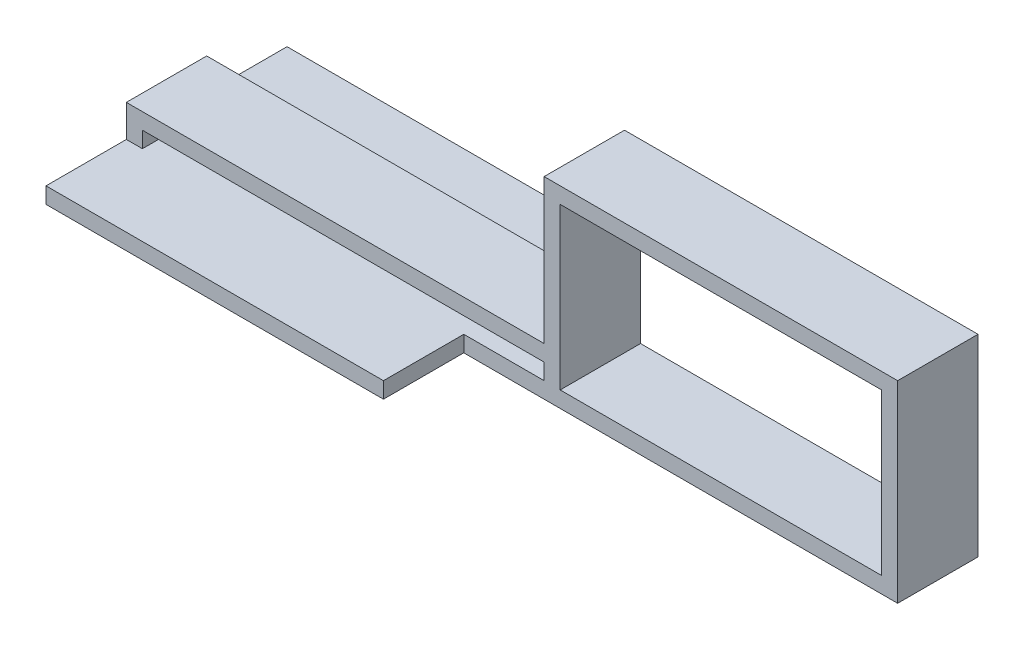
ISO-10303-21;
HEADER;
FILE_DESCRIPTION(('STEP AP214'),'2;1');
FILE_NAME('part.step','',(''),(''),'','','');
FILE_SCHEMA(('AUTOMOTIVE_DESIGN { 1 0 10303 214 1 1 1 1 }'));
ENDSEC;
DATA;
#1=APPLICATION_CONTEXT('core data for automotive mechanical design processes');
#2=APPLICATION_PROTOCOL_DEFINITION('international standard','automotive_design',2000,#1);
#3=PRODUCT_CONTEXT('',#1,'mechanical');
#4=PRODUCT('Part','Part','',(#3));
#5=PRODUCT_RELATED_PRODUCT_CATEGORY('part','',(#4));
#6=PRODUCT_DEFINITION_FORMATION('','',#4);
#7=PRODUCT_DEFINITION_CONTEXT('part definition',#1,'design');
#8=PRODUCT_DEFINITION('design','',#6,#7);
#9=PRODUCT_DEFINITION_SHAPE('','',#8);
#10=(LENGTH_UNIT() NAMED_UNIT(*) SI_UNIT(.MILLI.,.METRE.));
#11=(NAMED_UNIT(*) PLANE_ANGLE_UNIT() SI_UNIT($,.RADIAN.));
#12=(NAMED_UNIT(*) SI_UNIT($,.STERADIAN.) SOLID_ANGLE_UNIT());
#13=UNCERTAINTY_MEASURE_WITH_UNIT(LENGTH_MEASURE(1.E-05),#10,'distance_accuracy_value','');
#14=(GEOMETRIC_REPRESENTATION_CONTEXT(3) GLOBAL_UNCERTAINTY_ASSIGNED_CONTEXT((#13)) GLOBAL_UNIT_ASSIGNED_CONTEXT((#10,
#11,#12)) REPRESENTATION_CONTEXT('',''));
#15=CARTESIAN_POINT('',(0.,0.,0.));
#16=DIRECTION('',(0.,0.,1.));
#17=DIRECTION('',(1.,0.,0.));
#18=AXIS2_PLACEMENT_3D('',#15,#16,#17);
#19=CARTESIAN_POINT('',(-22.1705882352941,0.,-5.));
#20=DIRECTION('',(1.,0.,0.));
#21=DIRECTION('',(0.,0.,-1.));
#22=AXIS2_PLACEMENT_3D('',#19,#20,#21);
#23=PLANE('',#22);
#24=DIRECTION('',(0.,0.,1.));
#25=VECTOR('',#24,1.);
#26=CARTESIAN_POINT('',(-22.1705882352941,-22.2872549019608,-5.));
#27=LINE('',#26,#25);
#28=CARTESIAN_POINT('',(-22.1705882352941,-22.2872549019608,-5.));
#29=VERTEX_POINT('',#28);
#30=CARTESIAN_POINT('',(-22.1705882352941,-22.2872549019608,5.));
#31=VERTEX_POINT('',#30);
#32=EDGE_CURVE('E356',#29,#31,#27,.T.);
#33=ORIENTED_EDGE('',*,*,#32,.T.);
#34=DIRECTION('',(0.,1.,0.));
#35=VECTOR('',#34,1.);
#36=CARTESIAN_POINT('',(-22.1705882352941,0.,5.));
#37=LINE('',#36,#35);
#38=CARTESIAN_POINT('',(-22.1705882352941,-20.2872549019608,5.));
#39=VERTEX_POINT('',#38);
#40=EDGE_CURVE('E283',#31,#39,#37,.T.);
#41=ORIENTED_EDGE('',*,*,#40,.T.);
#42=DIRECTION('',(0.,0.,1.));
#43=VECTOR('',#42,1.);
#44=CARTESIAN_POINT('',(-22.1705882352941,-20.2872549019608,-5.));
#45=LINE('',#44,#43);
#46=CARTESIAN_POINT('',(-22.1705882352941,-20.2872549019608,-5.));
#47=VERTEX_POINT('',#46);
#48=EDGE_CURVE('E347',#47,#39,#45,.T.);
#49=ORIENTED_EDGE('',*,*,#48,.F.);
#50=DIRECTION('',(0.,1.,0.));
#51=VECTOR('',#50,1.);
#52=CARTESIAN_POINT('',(-22.1705882352941,0.,-5.));
#53=LINE('',#52,#51);
#54=EDGE_CURVE('E332',#29,#47,#53,.T.);
#55=ORIENTED_EDGE('',*,*,#54,.F.);
#56=EDGE_LOOP('',(#33,#41,#49,#55));
#57=FACE_BOUND('',#56,.T.);
#58=ADVANCED_FACE('F41',(#57),#23,.F.);
#59=CARTESIAN_POINT('',(0.,-20.2872549019608,-5.));
#60=DIRECTION('',(0.,-1.,0.));
#61=DIRECTION('',(0.,0.,-1.));
#62=AXIS2_PLACEMENT_3D('',#59,#60,#61);
#63=PLANE('',#62);
#64=ORIENTED_EDGE('',*,*,#48,.T.);
#65=DIRECTION('',(1.,0.,0.));
#66=VECTOR('',#65,1.);
#67=CARTESIAN_POINT('',(0.,-20.2872549019608,5.));
#68=LINE('',#67,#66);
#69=CARTESIAN_POINT('',(-72.1705882352941,-20.2872549019608,5.));
#70=VERTEX_POINT('',#69);
#71=EDGE_CURVE('E295',#70,#39,#68,.T.);
#72=ORIENTED_EDGE('',*,*,#71,.F.);
#73=DIRECTION('',(0.,0.,1.));
#74=VECTOR('',#73,1.);
#75=CARTESIAN_POINT('',(-72.1705882352941,-20.2872549019608,-5.));
#76=LINE('',#75,#74);
#77=CARTESIAN_POINT('',(-72.1705882352941,-20.2872549019608,-5.));
#78=VERTEX_POINT('',#77);
#79=EDGE_CURVE('E350',#78,#70,#76,.T.);
#80=ORIENTED_EDGE('',*,*,#79,.F.);
#81=DIRECTION('',(1.,0.,0.));
#82=VECTOR('',#81,1.);
#83=CARTESIAN_POINT('',(0.,-20.2872549019608,-5.));
#84=LINE('',#83,#82);
#85=EDGE_CURVE('E342',#78,#47,#84,.T.);
#86=ORIENTED_EDGE('',*,*,#85,.T.);
#87=EDGE_LOOP('',(#64,#72,#80,#86));
#88=FACE_BOUND('',#87,.T.);
#89=ADVANCED_FACE('F450',(#88),#63,.T.);
#90=CARTESIAN_POINT('',(-72.1705882352941,0.,-5.));
#91=DIRECTION('',(1.,0.,0.));
#92=DIRECTION('',(0.,0.,-1.));
#93=AXIS2_PLACEMENT_3D('',#90,#91,#92);
#94=PLANE('',#93);
#95=ORIENTED_EDGE('',*,*,#79,.T.);
#96=DIRECTION('',(0.,1.,0.));
#97=VECTOR('',#96,1.);
#98=CARTESIAN_POINT('',(-72.1705882352941,0.,5.));
#99=LINE('',#98,#97);
#100=CARTESIAN_POINT('',(-72.1705882352941,-22.2872549019608,5.));
#101=VERTEX_POINT('',#100);
#102=EDGE_CURVE('E291',#101,#70,#99,.T.);
#103=ORIENTED_EDGE('',*,*,#102,.F.);
#104=DIRECTION('',(0.,0.,1.));
#105=VECTOR('',#104,1.);
#106=CARTESIAN_POINT('',(-72.1705882352941,-22.2872549019608,-5.));
#107=LINE('',#106,#105);
#108=CARTESIAN_POINT('',(-72.1705882352941,-22.2872549019608,-5.));
#109=VERTEX_POINT('',#108);
#110=EDGE_CURVE('E353',#109,#101,#107,.T.);
#111=ORIENTED_EDGE('',*,*,#110,.F.);
#112=DIRECTION('',(0.,1.,0.));
#113=VECTOR('',#112,1.);
#114=CARTESIAN_POINT('',(-72.1705882352941,0.,-5.));
#115=LINE('',#114,#113);
#116=EDGE_CURVE('E338',#109,#78,#115,.T.);
#117=ORIENTED_EDGE('',*,*,#116,.T.);
#118=EDGE_LOOP('',(#95,#103,#111,#117));
#119=FACE_BOUND('',#118,.T.);
#120=ADVANCED_FACE('F418',(#119),#94,.T.);
#121=CARTESIAN_POINT('',(0.,-2.28725490196078,-5.));
#122=DIRECTION('',(0.,-1.,0.));
#123=DIRECTION('',(0.,0.,-1.));
#124=AXIS2_PLACEMENT_3D('',#121,#122,#123);
#125=PLANE('',#124);
#126=DIRECTION('',(0.,0.,1.));
#127=VECTOR('',#126,1.);
#128=CARTESIAN_POINT('',(19.8294117647059,-2.28725490196078,-5.));
#129=LINE('',#128,#127);
#130=CARTESIAN_POINT('',(19.8294117647059,-2.28725490196078,-5.));
#131=VERTEX_POINT('',#130);
#132=CARTESIAN_POINT('',(19.8294117647059,-2.28725490196078,5.));
#133=VERTEX_POINT('',#132);
#134=EDGE_CURVE('E368',#131,#133,#129,.T.);
#135=ORIENTED_EDGE('',*,*,#134,.T.);
#136=DIRECTION('',(1.,0.,0.));
#137=VECTOR('',#136,1.);
#138=CARTESIAN_POINT('',(0.,-2.28725490196078,5.));
#139=LINE('',#138,#137);
#140=CARTESIAN_POINT('',(-20.1705882352941,-2.28725490196078,5.));
#141=VERTEX_POINT('',#140);
#142=EDGE_CURVE('E267',#141,#133,#139,.T.);
#143=ORIENTED_EDGE('',*,*,#142,.F.);
#144=DIRECTION('',(0.,0.,1.));
#145=VECTOR('',#144,1.);
#146=CARTESIAN_POINT('',(-20.1705882352941,-2.28725490196078,-5.));
#147=LINE('',#146,#145);
#148=CARTESIAN_POINT('',(-20.1705882352941,-2.28725490196078,-5.));
#149=VERTEX_POINT('',#148);
#150=EDGE_CURVE('E359',#149,#141,#147,.T.);
#151=ORIENTED_EDGE('',*,*,#150,.F.);
#152=DIRECTION('',(1.,0.,0.));
#153=VECTOR('',#152,1.);
#154=CARTESIAN_POINT('',(0.,-2.28725490196078,-5.));
#155=LINE('',#154,#153);
#156=EDGE_CURVE('E317',#149,#131,#155,.T.);
#157=ORIENTED_EDGE('',*,*,#156,.T.);
#158=EDGE_LOOP('',(#135,#143,#151,#157));
#159=FACE_BOUND('',#158,.T.);
#160=ADVANCED_FACE('F464',(#159),#125,.T.);
#161=CARTESIAN_POINT('',(-20.1705882352941,0.,-5.));
#162=DIRECTION('',(-1.,0.,0.));
#163=DIRECTION('',(0.,-1.,0.));
#164=AXIS2_PLACEMENT_3D('',#161,#162,#163);
#165=PLANE('',#164);
#166=ORIENTED_EDGE('',*,*,#150,.T.);
#167=DIRECTION('',(0.,-1.,0.));
#168=VECTOR('',#167,1.);
#169=CARTESIAN_POINT('',(-20.1705882352941,0.,5.));
#170=LINE('',#169,#168);
#171=CARTESIAN_POINT('',(-20.1705882352941,-22.2872549019608,5.));
#172=VERTEX_POINT('',#171);
#173=EDGE_CURVE('E279',#141,#172,#170,.T.);
#174=ORIENTED_EDGE('',*,*,#173,.T.);
#175=DIRECTION('',(0.,0.,1.));
#176=VECTOR('',#175,1.);
#177=CARTESIAN_POINT('',(-20.1705882352941,-22.2872549019608,-5.));
#178=LINE('',#177,#176);
#179=CARTESIAN_POINT('',(-20.1705882352941,-22.2872549019608,-5.));
#180=VERTEX_POINT('',#179);
#181=EDGE_CURVE('E362',#180,#172,#178,.T.);
#182=ORIENTED_EDGE('',*,*,#181,.F.);
#183=DIRECTION('',(0.,-1.,0.));
#184=VECTOR('',#183,1.);
#185=CARTESIAN_POINT('',(-20.1705882352941,0.,-5.));
#186=LINE('',#185,#184);
#187=EDGE_CURVE('E328',#149,#180,#186,.T.);
#188=ORIENTED_EDGE('',*,*,#187,.F.);
#189=EDGE_LOOP('',(#166,#174,#182,#188));
#190=FACE_BOUND('',#189,.T.);
#191=ADVANCED_FACE('F460',(#190),#165,.F.);
#192=CARTESIAN_POINT('',(0.,-22.2872549019608,-5.));
#193=DIRECTION('',(0.,-1.,0.));
#194=DIRECTION('',(0.,0.,-1.));
#195=AXIS2_PLACEMENT_3D('',#192,#193,#194);
#196=PLANE('',#195);
#197=ORIENTED_EDGE('',*,*,#181,.T.);
#198=DIRECTION('',(1.,0.,0.));
#199=VECTOR('',#198,1.);
#200=CARTESIAN_POINT('',(0.,-22.2872549019608,5.));
#201=LINE('',#200,#199);
#202=CARTESIAN_POINT('',(19.8294117647059,-22.2872549019608,5.));
#203=VERTEX_POINT('',#202);
#204=EDGE_CURVE('E275',#172,#203,#201,.T.);
#205=ORIENTED_EDGE('',*,*,#204,.T.);
#206=DIRECTION('',(0.,0.,1.));
#207=VECTOR('',#206,1.);
#208=CARTESIAN_POINT('',(19.8294117647059,-22.2872549019608,-5.));
#209=LINE('',#208,#207);
#210=CARTESIAN_POINT('',(19.8294117647059,-22.2872549019608,-5.));
#211=VERTEX_POINT('',#210);
#212=EDGE_CURVE('E365',#211,#203,#209,.T.);
#213=ORIENTED_EDGE('',*,*,#212,.F.);
#214=DIRECTION('',(1.,0.,0.));
#215=VECTOR('',#214,1.);
#216=CARTESIAN_POINT('',(0.,-22.2872549019608,-5.));
#217=LINE('',#216,#215);
#218=EDGE_CURVE('E325',#180,#211,#217,.T.);
#219=ORIENTED_EDGE('',*,*,#218,.F.);
#220=EDGE_LOOP('',(#197,#205,#213,#219));
#221=FACE_BOUND('',#220,.T.);
#222=ADVANCED_FACE('F463',(#221),#196,.F.);
#223=CARTESIAN_POINT('',(-22.1705882352941,0.,-5.));
#224=DIRECTION('',(1.,0.,0.));
#225=DIRECTION('',(0.,0.,-1.));
#226=AXIS2_PLACEMENT_3D('',#223,#224,#225);
#227=PLANE('',#226);
#228=DIRECTION('',(0.,0.,1.));
#229=VECTOR('',#228,1.);
#230=CARTESIAN_POINT('',(-22.1705882352941,-18.2872549019608,-5.));
#231=LINE('',#230,#229);
#232=CARTESIAN_POINT('',(-22.1705882352941,-18.2872549019608,-5.));
#233=VERTEX_POINT('',#232);
#234=CARTESIAN_POINT('',(-22.1705882352941,-18.2872549019608,5.));
#235=VERTEX_POINT('',#234);
#236=EDGE_CURVE('E346',#233,#235,#231,.T.);
#237=ORIENTED_EDGE('',*,*,#236,.T.);
#238=DIRECTION('',(0.,1.,0.));
#239=VECTOR('',#238,1.);
#240=CARTESIAN_POINT('',(-22.1705882352941,0.,5.));
#241=LINE('',#240,#239);
#242=CARTESIAN_POINT('',(-22.1705882352941,-0.287254901960776,5.));
#243=VERTEX_POINT('',#242);
#244=EDGE_CURVE('E244',#235,#243,#241,.T.);
#245=ORIENTED_EDGE('',*,*,#244,.T.);
#246=DIRECTION('',(0.,0.,1.));
#247=VECTOR('',#246,1.);
#248=CARTESIAN_POINT('',(-22.1705882352941,-0.287254901960776,-5.));
#249=LINE('',#248,#247);
#250=CARTESIAN_POINT('',(-22.1705882352941,-0.287254901960776,-5.));
#251=VERTEX_POINT('',#250);
#252=EDGE_CURVE('E371',#251,#243,#249,.T.);
#253=ORIENTED_EDGE('',*,*,#252,.F.);
#254=DIRECTION('',(0.,1.,0.));
#255=VECTOR('',#254,1.);
#256=CARTESIAN_POINT('',(-22.1705882352941,0.,-5.));
#257=LINE('',#256,#255);
#258=EDGE_CURVE('E299',#233,#251,#257,.T.);
#259=ORIENTED_EDGE('',*,*,#258,.F.);
#260=EDGE_LOOP('',(#237,#245,#253,#259));
#261=FACE_BOUND('',#260,.T.);
#262=ADVANCED_FACE('F43',(#261),#227,.F.);
#263=CARTESIAN_POINT('',(0.,-0.287254901960776,-5.));
#264=DIRECTION('',(0.,-1.,0.));
#265=DIRECTION('',(0.,0.,-1.));
#266=AXIS2_PLACEMENT_3D('',#263,#264,#265);
#267=PLANE('',#266);
#268=ORIENTED_EDGE('',*,*,#252,.T.);
#269=DIRECTION('',(1.,0.,0.));
#270=VECTOR('',#269,1.);
#271=CARTESIAN_POINT('',(0.,-0.287254901960776,5.));
#272=LINE('',#271,#270);
#273=CARTESIAN_POINT('',(21.8294117647059,-0.287254901960776,5.));
#274=VERTEX_POINT('',#273);
#275=EDGE_CURVE('E263',#243,#274,#272,.T.);
#276=ORIENTED_EDGE('',*,*,#275,.T.);
#277=DIRECTION('',(0.,0.,1.));
#278=VECTOR('',#277,1.);
#279=CARTESIAN_POINT('',(21.8294117647059,-0.287254901960776,-5.));
#280=LINE('',#279,#278);
#281=CARTESIAN_POINT('',(21.8294117647059,-0.287254901960776,-5.));
#282=VERTEX_POINT('',#281);
#283=EDGE_CURVE('E374',#282,#274,#280,.T.);
#284=ORIENTED_EDGE('',*,*,#283,.F.);
#285=DIRECTION('',(1.,0.,0.));
#286=VECTOR('',#285,1.);
#287=CARTESIAN_POINT('',(0.,-0.287254901960776,-5.));
#288=LINE('',#287,#286);
#289=EDGE_CURVE('E314',#251,#282,#288,.T.);
#290=ORIENTED_EDGE('',*,*,#289,.F.);
#291=EDGE_LOOP('',(#268,#276,#284,#290));
#292=FACE_BOUND('',#291,.T.);
#293=ADVANCED_FACE('F431',(#292),#267,.F.);
#294=CARTESIAN_POINT('',(21.8294117647059,0.,-5.));
#295=DIRECTION('',(-1.,0.,0.));
#296=DIRECTION('',(0.,0.,1.));
#297=AXIS2_PLACEMENT_3D('',#294,#295,#296);
#298=PLANE('',#297);
#299=ORIENTED_EDGE('',*,*,#283,.T.);
#300=DIRECTION('',(0.,-1.,0.));
#301=VECTOR('',#300,1.);
#302=CARTESIAN_POINT('',(21.8294117647059,0.,5.));
#303=LINE('',#302,#301);
#304=CARTESIAN_POINT('',(21.8294117647059,-24.2872549019608,5.));
#305=VERTEX_POINT('',#304);
#306=EDGE_CURVE('E259',#274,#305,#303,.T.);
#307=ORIENTED_EDGE('',*,*,#306,.T.);
#308=DIRECTION('',(0.,0.,1.));
#309=VECTOR('',#308,1.);
#310=CARTESIAN_POINT('',(21.8294117647059,-24.2872549019608,-5.));
#311=LINE('',#310,#309);
#312=CARTESIAN_POINT('',(21.8294117647059,-24.2872549019608,-5.));
#313=VERTEX_POINT('',#312);
#314=EDGE_CURVE('E377',#313,#305,#311,.T.);
#315=ORIENTED_EDGE('',*,*,#314,.F.);
#316=DIRECTION('',(0.,-1.,0.));
#317=VECTOR('',#316,1.);
#318=CARTESIAN_POINT('',(21.8294117647059,0.,-5.));
#319=LINE('',#318,#317);
#320=EDGE_CURVE('E311',#282,#313,#319,.T.);
#321=ORIENTED_EDGE('',*,*,#320,.F.);
#322=EDGE_LOOP('',(#299,#307,#315,#321));
#323=FACE_BOUND('',#322,.T.);
#324=ADVANCED_FACE('F436',(#323),#298,.F.);
#325=CARTESIAN_POINT('',(0.,-24.2872549019608,-5.));
#326=DIRECTION('',(0.,1.,0.));
#327=DIRECTION('',(0.,0.,1.));
#328=AXIS2_PLACEMENT_3D('',#325,#326,#327);
#329=PLANE('',#328);
#330=DIRECTION('',(-1.,0.,0.));
#331=VECTOR('',#330,1.);
#332=CARTESIAN_POINT('',(0.,-24.2872549019608,5.));
#333=LINE('',#332,#331);
#334=CARTESIAN_POINT('',(-32.1705882352941,-24.2872549019608,5.));
#335=VERTEX_POINT('',#334);
#336=EDGE_CURVE('E255',#305,#335,#333,.T.);
#337=ORIENTED_EDGE('',*,*,#336,.T.);
#338=DIRECTION('',(0.,0.,1.));
#339=VECTOR('',#338,1.);
#340=CARTESIAN_POINT('',(-32.1705882352941,-24.2872549019608,-15.));
#341=LINE('',#340,#339);
#342=CARTESIAN_POINT('',(-32.1705882352941,-24.2872549019608,15.));
#343=VERTEX_POINT('',#342);
#344=EDGE_CURVE('E234',#335,#343,#341,.T.);
#345=ORIENTED_EDGE('',*,*,#344,.T.);
#346=DIRECTION('',(1.,0.,0.));
#347=VECTOR('',#346,1.);
#348=CARTESIAN_POINT('',(0.,-24.2872549019608,15.));
#349=LINE('',#348,#347);
#350=CARTESIAN_POINT('',(-74.1705882352941,-24.2872549019608,15.));
#351=VERTEX_POINT('',#350);
#352=EDGE_CURVE('E199',#351,#343,#349,.T.);
#353=ORIENTED_EDGE('',*,*,#352,.F.);
#354=DIRECTION('',(0.,0.,1.));
#355=VECTOR('',#354,1.);
#356=CARTESIAN_POINT('',(-74.1705882352941,-24.2872549019608,-5.));
#357=LINE('',#356,#355);
#358=CARTESIAN_POINT('',(-74.1705882352941,-24.2872549019608,-15.));
#359=VERTEX_POINT('',#358);
#360=EDGE_CURVE('E194',#359,#351,#357,.T.);
#361=ORIENTED_EDGE('',*,*,#360,.F.);
#362=DIRECTION('',(1.,0.,0.));
#363=VECTOR('',#362,1.);
#364=CARTESIAN_POINT('',(0.,-24.2872549019608,-15.));
#365=LINE('',#364,#363);
#366=CARTESIAN_POINT('',(-32.1705882352941,-24.2872549019608,-15.));
#367=VERTEX_POINT('',#366);
#368=EDGE_CURVE('E219',#359,#367,#365,.T.);
#369=ORIENTED_EDGE('',*,*,#368,.T.);
#370=CARTESIAN_POINT('',(-32.1705882352941,-24.2872549019608,-5.));
#371=VERTEX_POINT('',#370);
#372=EDGE_CURVE('E231',#367,#371,#341,.T.);
#373=ORIENTED_EDGE('',*,*,#372,.T.);
#374=DIRECTION('',(-1.,0.,0.));
#375=VECTOR('',#374,1.);
#376=CARTESIAN_POINT('',(0.,-24.2872549019608,-5.));
#377=LINE('',#376,#375);
#378=EDGE_CURVE('E62',#313,#371,#377,.T.);
#379=ORIENTED_EDGE('',*,*,#378,.F.);
#380=ORIENTED_EDGE('',*,*,#314,.T.);
#381=EDGE_LOOP('',(#337,#345,#353,#361,#369,#373,#379,#380));
#382=FACE_BOUND('',#381,.T.);
#383=ADVANCED_FACE('F438',(#382),#329,.F.);
#384=CARTESIAN_POINT('',(-74.1705882352941,0.,-5.));
#385=DIRECTION('',(1.,0.,0.));
#386=DIRECTION('',(0.,0.,-1.));
#387=AXIS2_PLACEMENT_3D('',#384,#385,#386);
#388=PLANE('',#387);
#389=DIRECTION('',(0.,1.,0.));
#390=VECTOR('',#389,1.);
#391=CARTESIAN_POINT('',(-74.1705882352941,0.,-5.));
#392=LINE('',#391,#390);
#393=CARTESIAN_POINT('',(-74.1705882352941,-22.2872549019608,-5.));
#394=VERTEX_POINT('',#393);
#395=CARTESIAN_POINT('',(-74.1705882352941,-18.2872549019608,-5.));
#396=VERTEX_POINT('',#395);
#397=EDGE_CURVE('E306',#394,#396,#392,.T.);
#398=ORIENTED_EDGE('',*,*,#397,.F.);
#399=DIRECTION('',(0.,0.,1.));
#400=VECTOR('',#399,1.);
#401=CARTESIAN_POINT('',(-74.1705882352941,-22.2872549019608,-15.));
#402=LINE('',#401,#400);
#403=CARTESIAN_POINT('',(-74.1705882352941,-22.2872549019608,-15.));
#404=VERTEX_POINT('',#403);
#405=EDGE_CURVE('E187',#404,#394,#402,.T.);
#406=ORIENTED_EDGE('',*,*,#405,.F.);
#407=DIRECTION('',(0.,-1.,0.));
#408=VECTOR('',#407,1.);
#409=CARTESIAN_POINT('',(-74.1705882352941,0.,-15.));
#410=LINE('',#409,#408);
#411=EDGE_CURVE('E216',#404,#359,#410,.T.);
#412=ORIENTED_EDGE('',*,*,#411,.T.);
#413=ORIENTED_EDGE('',*,*,#360,.T.);
#414=DIRECTION('',(0.,-1.,0.));
#415=VECTOR('',#414,1.);
#416=CARTESIAN_POINT('',(-74.1705882352941,0.,15.));
#417=LINE('',#416,#415);
#418=CARTESIAN_POINT('',(-74.1705882352941,-22.2872549019608,15.));
#419=VERTEX_POINT('',#418);
#420=EDGE_CURVE('E191',#419,#351,#417,.T.);
#421=ORIENTED_EDGE('',*,*,#420,.F.);
#422=CARTESIAN_POINT('',(-74.1705882352941,-22.2872549019608,5.));
#423=VERTEX_POINT('',#422);
#424=EDGE_CURVE('E177',#423,#419,#402,.T.);
#425=ORIENTED_EDGE('',*,*,#424,.F.);
#426=DIRECTION('',(0.,1.,0.));
#427=VECTOR('',#426,1.);
#428=CARTESIAN_POINT('',(-74.1705882352941,0.,5.));
#429=LINE('',#428,#427);
#430=CARTESIAN_POINT('',(-74.1705882352941,-18.2872549019608,5.));
#431=VERTEX_POINT('',#430);
#432=EDGE_CURVE('E252',#423,#431,#429,.T.);
#433=ORIENTED_EDGE('',*,*,#432,.T.);
#434=DIRECTION('',(0.,0.,1.));
#435=VECTOR('',#434,1.);
#436=CARTESIAN_POINT('',(-74.1705882352941,-18.2872549019608,-5.));
#437=LINE('',#436,#435);
#438=EDGE_CURVE('E382',#396,#431,#437,.T.);
#439=ORIENTED_EDGE('',*,*,#438,.F.);
#440=EDGE_LOOP('',(#398,#406,#412,#413,#421,#425,#433,#439));
#441=FACE_BOUND('',#440,.T.);
#442=ADVANCED_FACE('F192',(#441),#388,.F.);
#443=CARTESIAN_POINT('',(19.8294117647059,0.,-5.));
#444=DIRECTION('',(-1.,0.,0.));
#445=DIRECTION('',(0.,0.,1.));
#446=AXIS2_PLACEMENT_3D('',#443,#444,#445);
#447=PLANE('',#446);
#448=ORIENTED_EDGE('',*,*,#212,.T.);
#449=DIRECTION('',(0.,-1.,0.));
#450=VECTOR('',#449,1.);
#451=CARTESIAN_POINT('',(19.8294117647059,0.,5.));
#452=LINE('',#451,#450);
#453=EDGE_CURVE('E271',#133,#203,#452,.T.);
#454=ORIENTED_EDGE('',*,*,#453,.F.);
#455=ORIENTED_EDGE('',*,*,#134,.F.);
#456=DIRECTION('',(0.,-1.,0.));
#457=VECTOR('',#456,1.);
#458=CARTESIAN_POINT('',(19.8294117647059,0.,-5.));
#459=LINE('',#458,#457);
#460=EDGE_CURVE('E321',#131,#211,#459,.T.);
#461=ORIENTED_EDGE('',*,*,#460,.T.);
#462=EDGE_LOOP('',(#448,#454,#455,#461));
#463=FACE_BOUND('',#462,.T.);
#464=ADVANCED_FACE('F446',(#463),#447,.T.);
#465=CARTESIAN_POINT('',(0.,-18.2872549019608,-5.));
#466=DIRECTION('',(0.,-1.,0.));
#467=DIRECTION('',(0.,0.,-1.));
#468=AXIS2_PLACEMENT_3D('',#465,#466,#467);
#469=PLANE('',#468);
#470=ORIENTED_EDGE('',*,*,#438,.T.);
#471=DIRECTION('',(1.,0.,0.));
#472=VECTOR('',#471,1.);
#473=CARTESIAN_POINT('',(0.,-18.2872549019608,5.));
#474=LINE('',#473,#472);
#475=EDGE_CURVE('E248',#431,#235,#474,.T.);
#476=ORIENTED_EDGE('',*,*,#475,.T.);
#477=ORIENTED_EDGE('',*,*,#236,.F.);
#478=DIRECTION('',(1.,0.,0.));
#479=VECTOR('',#478,1.);
#480=CARTESIAN_POINT('',(0.,-18.2872549019608,-5.));
#481=LINE('',#480,#479);
#482=EDGE_CURVE('E303',#396,#233,#481,.T.);
#483=ORIENTED_EDGE('',*,*,#482,.F.);
#484=EDGE_LOOP('',(#470,#476,#477,#483));
#485=FACE_BOUND('',#484,.T.);
#486=ADVANCED_FACE('F423',(#485),#469,.F.);
#487=CARTESIAN_POINT('',(0.,-22.2872549019608,-5.));
#488=DIRECTION('',(0.,1.,0.));
#489=DIRECTION('',(0.,0.,1.));
#490=AXIS2_PLACEMENT_3D('',#487,#488,#489);
#491=PLANE('',#490);
#492=DIRECTION('',(-1.,0.,0.));
#493=VECTOR('',#492,1.);
#494=CARTESIAN_POINT('',(0.,-22.2872549019608,-5.));
#495=LINE('',#494,#493);
#496=CARTESIAN_POINT('',(-32.1705882352941,-22.2872549019608,-5.));
#497=VERTEX_POINT('',#496);
#498=EDGE_CURVE('E335',#29,#497,#495,.T.);
#499=ORIENTED_EDGE('',*,*,#498,.T.);
#500=DIRECTION('',(0.,0.,1.));
#501=VECTOR('',#500,1.);
#502=CARTESIAN_POINT('',(-32.1705882352941,-22.2872549019608,-15.));
#503=LINE('',#502,#501);
#504=CARTESIAN_POINT('',(-32.1705882352941,-22.2872549019608,-15.));
#505=VERTEX_POINT('',#504);
#506=EDGE_CURVE('E226',#505,#497,#503,.T.);
#507=ORIENTED_EDGE('',*,*,#506,.F.);
#508=DIRECTION('',(-1.,0.,0.));
#509=VECTOR('',#508,1.);
#510=CARTESIAN_POINT('',(0.,-22.2872549019608,-15.));
#511=LINE('',#510,#509);
#512=EDGE_CURVE('E212',#505,#404,#511,.T.);
#513=ORIENTED_EDGE('',*,*,#512,.T.);
#514=ORIENTED_EDGE('',*,*,#405,.T.);
#515=DIRECTION('',(-1.,0.,0.));
#516=VECTOR('',#515,1.);
#517=CARTESIAN_POINT('',(0.,-22.2872549019608,-5.));
#518=LINE('',#517,#516);
#519=EDGE_CURVE('E240',#109,#394,#518,.T.);
#520=ORIENTED_EDGE('',*,*,#519,.F.);
#521=ORIENTED_EDGE('',*,*,#110,.T.);
#522=DIRECTION('',(-1.,0.,0.));
#523=VECTOR('',#522,1.);
#524=CARTESIAN_POINT('',(0.,-22.2872549019608,5.));
#525=LINE('',#524,#523);
#526=EDGE_CURVE('E11',#101,#423,#525,.T.);
#527=ORIENTED_EDGE('',*,*,#526,.T.);
#528=ORIENTED_EDGE('',*,*,#424,.T.);
#529=DIRECTION('',(-1.,0.,0.));
#530=VECTOR('',#529,1.);
#531=CARTESIAN_POINT('',(0.,-22.2872549019608,15.));
#532=LINE('',#531,#530);
#533=CARTESIAN_POINT('',(-32.1705882352941,-22.2872549019608,15.));
#534=VERTEX_POINT('',#533);
#535=EDGE_CURVE('E182',#534,#419,#532,.T.);
#536=ORIENTED_EDGE('',*,*,#535,.F.);
#537=CARTESIAN_POINT('',(-32.1705882352941,-22.2872549019608,5.));
#538=VERTEX_POINT('',#537);
#539=EDGE_CURVE('E230',#538,#534,#503,.T.);
#540=ORIENTED_EDGE('',*,*,#539,.F.);
#541=DIRECTION('',(-1.,0.,0.));
#542=VECTOR('',#541,1.);
#543=CARTESIAN_POINT('',(0.,-22.2872549019608,5.));
#544=LINE('',#543,#542);
#545=EDGE_CURVE('E287',#31,#538,#544,.T.);
#546=ORIENTED_EDGE('',*,*,#545,.F.);
#547=ORIENTED_EDGE('',*,*,#32,.F.);
#548=EDGE_LOOP('',(#499,#507,#513,#514,#520,#521,#527,#528,#536,#540,#546,#547));
#549=FACE_BOUND('',#548,.T.);
#550=ADVANCED_FACE('F179',(#549),#491,.T.);
#551=CARTESIAN_POINT('',(0.,0.,-5.));
#552=DIRECTION('',(0.,0.,1.));
#553=DIRECTION('',(1.,0.,0.));
#554=AXIS2_PLACEMENT_3D('',#551,#552,#553);
#555=PLANE('',#554);
#556=ORIENTED_EDGE('',*,*,#116,.F.);
#557=ORIENTED_EDGE('',*,*,#519,.T.);
#558=ORIENTED_EDGE('',*,*,#397,.T.);
#559=ORIENTED_EDGE('',*,*,#482,.T.);
#560=ORIENTED_EDGE('',*,*,#258,.T.);
#561=ORIENTED_EDGE('',*,*,#289,.T.);
#562=ORIENTED_EDGE('',*,*,#320,.T.);
#563=ORIENTED_EDGE('',*,*,#378,.T.);
#564=DIRECTION('',(0.,1.,0.));
#565=VECTOR('',#564,1.);
#566=CARTESIAN_POINT('',(-32.1705882352941,0.,-5.));
#567=LINE('',#566,#565);
#568=EDGE_CURVE('E57',#371,#497,#567,.T.);
#569=ORIENTED_EDGE('',*,*,#568,.T.);
#570=ORIENTED_EDGE('',*,*,#498,.F.);
#571=ORIENTED_EDGE('',*,*,#54,.T.);
#572=ORIENTED_EDGE('',*,*,#85,.F.);
#573=EDGE_LOOP('',(#556,#557,#558,#559,#560,#561,#562,#563,#569,#570,#571,#572));
#574=FACE_BOUND('',#573,.T.);
#575=ORIENTED_EDGE('',*,*,#156,.F.);
#576=ORIENTED_EDGE('',*,*,#187,.T.);
#577=ORIENTED_EDGE('',*,*,#218,.T.);
#578=ORIENTED_EDGE('',*,*,#460,.F.);
#579=EDGE_LOOP('',(#575,#576,#577,#578));
#580=FACE_BOUND('',#579,.T.);
#581=ADVANCED_FACE('F414',(#574,#580),#555,.F.);
#582=CARTESIAN_POINT('',(0.,0.,5.));
#583=DIRECTION('',(0.,0.,1.));
#584=DIRECTION('',(1.,0.,0.));
#585=AXIS2_PLACEMENT_3D('',#582,#583,#584);
#586=PLANE('',#585);
#587=ORIENTED_EDGE('',*,*,#526,.F.);
#588=ORIENTED_EDGE('',*,*,#102,.T.);
#589=ORIENTED_EDGE('',*,*,#71,.T.);
#590=ORIENTED_EDGE('',*,*,#40,.F.);
#591=ORIENTED_EDGE('',*,*,#545,.T.);
#592=DIRECTION('',(0.,1.,0.));
#593=VECTOR('',#592,1.);
#594=CARTESIAN_POINT('',(-32.1705882352941,0.,5.));
#595=LINE('',#594,#593);
#596=EDGE_CURVE('E50',#335,#538,#595,.T.);
#597=ORIENTED_EDGE('',*,*,#596,.F.);
#598=ORIENTED_EDGE('',*,*,#336,.F.);
#599=ORIENTED_EDGE('',*,*,#306,.F.);
#600=ORIENTED_EDGE('',*,*,#275,.F.);
#601=ORIENTED_EDGE('',*,*,#244,.F.);
#602=ORIENTED_EDGE('',*,*,#475,.F.);
#603=ORIENTED_EDGE('',*,*,#432,.F.);
#604=EDGE_LOOP('',(#587,#588,#589,#590,#591,#597,#598,#599,#600,#601,#602,#603));
#605=FACE_BOUND('',#604,.T.);
#606=ORIENTED_EDGE('',*,*,#142,.T.);
#607=ORIENTED_EDGE('',*,*,#453,.T.);
#608=ORIENTED_EDGE('',*,*,#204,.F.);
#609=ORIENTED_EDGE('',*,*,#173,.F.);
#610=EDGE_LOOP('',(#606,#607,#608,#609));
#611=FACE_BOUND('',#610,.T.);
#612=ADVANCED_FACE('F396',(#605,#611),#586,.T.);
#613=CARTESIAN_POINT('',(0.,0.,15.));
#614=DIRECTION('',(0.,0.,1.));
#615=DIRECTION('',(1.,0.,0.));
#616=AXIS2_PLACEMENT_3D('',#613,#614,#615);
#617=PLANE('',#616);
#618=ORIENTED_EDGE('',*,*,#535,.T.);
#619=ORIENTED_EDGE('',*,*,#420,.T.);
#620=ORIENTED_EDGE('',*,*,#352,.T.);
#621=DIRECTION('',(0.,1.,0.));
#622=VECTOR('',#621,1.);
#623=CARTESIAN_POINT('',(-32.1705882352941,0.,15.));
#624=LINE('',#623,#622);
#625=EDGE_CURVE('E204',#343,#534,#624,.T.);
#626=ORIENTED_EDGE('',*,*,#625,.T.);
#627=EDGE_LOOP('',(#618,#619,#620,#626));
#628=FACE_BOUND('',#627,.T.);
#629=ADVANCED_FACE('F202',(#628),#617,.T.);
#630=CARTESIAN_POINT('',(-32.1705882352941,0.,-15.));
#631=DIRECTION('',(1.,0.,0.));
#632=DIRECTION('',(0.,0.,-1.));
#633=AXIS2_PLACEMENT_3D('',#630,#631,#632);
#634=PLANE('',#633);
#635=ORIENTED_EDGE('',*,*,#344,.F.);
#636=ORIENTED_EDGE('',*,*,#596,.T.);
#637=ORIENTED_EDGE('',*,*,#539,.T.);
#638=ORIENTED_EDGE('',*,*,#625,.F.);
#639=EDGE_LOOP('',(#635,#636,#637,#638));
#640=FACE_BOUND('',#639,.T.);
#641=ADVANCED_FACE('F390',(#640),#634,.T.);
#642=ORIENTED_EDGE('',*,*,#568,.F.);
#643=ORIENTED_EDGE('',*,*,#372,.F.);
#644=DIRECTION('',(0.,1.,0.));
#645=VECTOR('',#644,1.);
#646=CARTESIAN_POINT('',(-32.1705882352941,0.,-15.));
#647=LINE('',#646,#645);
#648=EDGE_CURVE('E188',#367,#505,#647,.T.);
#649=ORIENTED_EDGE('',*,*,#648,.T.);
#650=ORIENTED_EDGE('',*,*,#506,.T.);
#651=EDGE_LOOP('',(#642,#643,#649,#650));
#652=FACE_BOUND('',#651,.T.);
#653=ADVANCED_FACE('F404',(#652),#634,.T.);
#654=CARTESIAN_POINT('',(0.,0.,-15.));
#655=DIRECTION('',(0.,0.,1.));
#656=DIRECTION('',(1.,0.,0.));
#657=AXIS2_PLACEMENT_3D('',#654,#655,#656);
#658=PLANE('',#657);
#659=ORIENTED_EDGE('',*,*,#512,.F.);
#660=ORIENTED_EDGE('',*,*,#648,.F.);
#661=ORIENTED_EDGE('',*,*,#368,.F.);
#662=ORIENTED_EDGE('',*,*,#411,.F.);
#663=EDGE_LOOP('',(#659,#660,#661,#662));
#664=FACE_BOUND('',#663,.T.);
#665=ADVANCED_FACE('F408',(#664),#658,.F.);
#666=CLOSED_SHELL('',(#58,#89,#120,#160,#191,#222,#262,#293,#324,#383,#442,#464,#486,#550,#581,
#612,#629,#641,#653,#665));
#667=MANIFOLD_SOLID_BREP('B2',#666);
#668=ADVANCED_BREP_SHAPE_REPRESENTATION('',(#18,#667),#14);
#669=SHAPE_DEFINITION_REPRESENTATION(#9,#668);
ENDSEC;
END-ISO-10303-21;
